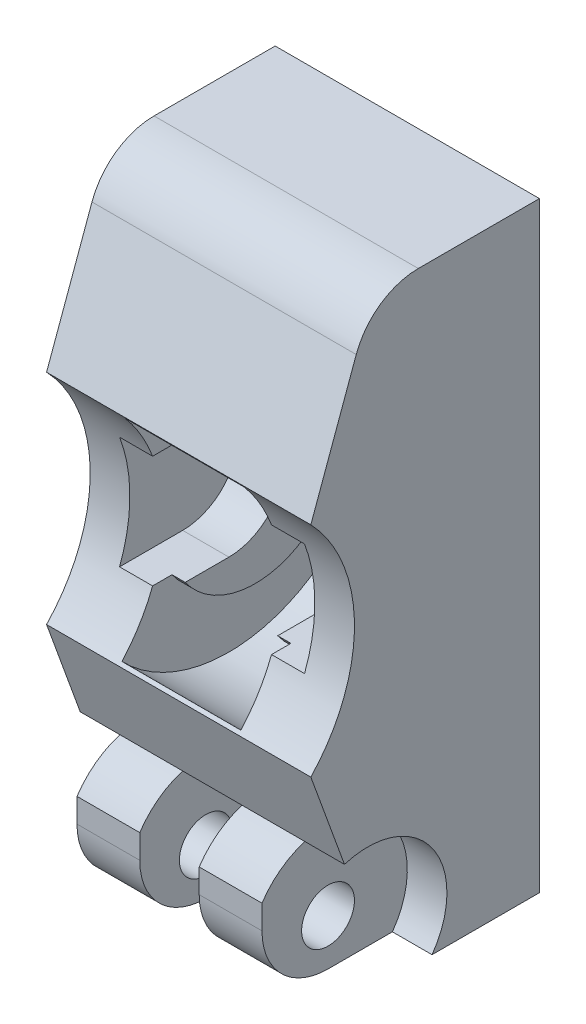
ISO-10303-21;
HEADER;
FILE_DESCRIPTION(('STEP AP214'),'2;1');
FILE_NAME('part.step','',(''),(''),'','','');
FILE_SCHEMA(('AUTOMOTIVE_DESIGN { 1 0 10303 214 1 1 1 1 }'));
ENDSEC;
DATA;
#1=APPLICATION_CONTEXT('core data for automotive mechanical design processes');
#2=APPLICATION_PROTOCOL_DEFINITION('international standard','automotive_design',2000,#1);
#3=PRODUCT_CONTEXT('',#1,'mechanical');
#4=PRODUCT('Part','Part','',(#3));
#5=PRODUCT_RELATED_PRODUCT_CATEGORY('part','',(#4));
#6=PRODUCT_DEFINITION_FORMATION('','',#4);
#7=PRODUCT_DEFINITION_CONTEXT('part definition',#1,'design');
#8=PRODUCT_DEFINITION('design','',#6,#7);
#9=PRODUCT_DEFINITION_SHAPE('','',#8);
#10=(LENGTH_UNIT() NAMED_UNIT(*) SI_UNIT(.MILLI.,.METRE.));
#11=(NAMED_UNIT(*) PLANE_ANGLE_UNIT() SI_UNIT($,.RADIAN.));
#12=(NAMED_UNIT(*) SI_UNIT($,.STERADIAN.) SOLID_ANGLE_UNIT());
#13=UNCERTAINTY_MEASURE_WITH_UNIT(LENGTH_MEASURE(1.E-05),#10,'distance_accuracy_value','');
#14=(GEOMETRIC_REPRESENTATION_CONTEXT(3) GLOBAL_UNCERTAINTY_ASSIGNED_CONTEXT((#13)) GLOBAL_UNIT_ASSIGNED_CONTEXT((#10,
#11,#12)) REPRESENTATION_CONTEXT('',''));
#15=CARTESIAN_POINT('',(0.,0.,0.));
#16=DIRECTION('',(0.,0.,1.));
#17=DIRECTION('',(1.,0.,0.));
#18=AXIS2_PLACEMENT_3D('',#15,#16,#17);
#19=CARTESIAN_POINT('',(20.,-22.75,18.));
#20=DIRECTION('',(0.,0.,-1.));
#21=DIRECTION('',(-1.,0.,0.));
#22=AXIS2_PLACEMENT_3D('',#19,#20,#21);
#23=PLANE('',#22);
#24=DIRECTION('',(0.,1.,0.));
#25=VECTOR('',#24,1.);
#26=CARTESIAN_POINT('',(17.,-22.75,18.));
#27=LINE('',#26,#25);
#28=CARTESIAN_POINT('',(17.,-17.75,18.));
#29=VERTEX_POINT('',#28);
#30=CARTESIAN_POINT('',(17.,-15.9333752096446,18.));
#31=VERTEX_POINT('',#30);
#32=EDGE_CURVE('E618',#29,#31,#27,.T.);
#33=ORIENTED_EDGE('',*,*,#32,.T.);
#34=DIRECTION('',(-1.,0.,0.));
#35=VECTOR('',#34,1.);
#36=CARTESIAN_POINT('',(29.9592339664477,-15.9333752096446,18.));
#37=LINE('',#36,#35);
#38=CARTESIAN_POINT('',(12.25,-15.9333752096446,18.));
#39=VERTEX_POINT('',#38);
#40=EDGE_CURVE('E264',#31,#39,#37,.T.);
#41=ORIENTED_EDGE('',*,*,#40,.T.);
#42=DIRECTION('',(0.,1.,0.));
#43=VECTOR('',#42,1.);
#44=CARTESIAN_POINT('',(12.25,-22.75,18.));
#45=LINE('',#44,#43);
#46=CARTESIAN_POINT('',(12.25,-17.75,18.));
#47=VERTEX_POINT('',#46);
#48=EDGE_CURVE('E386',#47,#39,#45,.T.);
#49=ORIENTED_EDGE('',*,*,#48,.F.);
#50=DIRECTION('',(-1.,0.,0.));
#51=VECTOR('',#50,1.);
#52=CARTESIAN_POINT('',(20.,-17.75,18.));
#53=LINE('',#52,#51);
#54=EDGE_CURVE('E318',#47,#29,#53,.F.);
#55=ORIENTED_EDGE('',*,*,#54,.T.);
#56=EDGE_LOOP('',(#33,#41,#49,#55));
#57=FACE_BOUND('',#56,.T.);
#58=ADVANCED_FACE('F35',(#57),#23,.F.);
#59=CARTESIAN_POINT('',(20.001,-19.25,13.));
#60=DIRECTION('',(-1.,0.,0.));
#61=DIRECTION('',(0.,0.,1.));
#62=AXIS2_PLACEMENT_3D('',#59,#60,#61);
#63=CYLINDRICAL_SURFACE('',#62,2.00000000000001);
#64=CARTESIAN_POINT('',(7.75,-19.25,13.));
#65=DIRECTION('',(-1.,0.,0.));
#66=DIRECTION('',(0.,0.,1.));
#67=AXIS2_PLACEMENT_3D('',#64,#65,#66);
#68=CIRCLE('',#67,2.00000000000001);
#69=CARTESIAN_POINT('',(7.75,-19.25,15.));
#70=VERTEX_POINT('',#69);
#71=EDGE_CURVE('E373',#70,#70,#68,.F.);
#72=ORIENTED_EDGE('',*,*,#71,.T.);
#73=EDGE_LOOP('',(#72));
#74=FACE_BOUND('',#73,.T.);
#75=CARTESIAN_POINT('',(3.,-19.25,13.));
#76=DIRECTION('',(-1.,0.,0.));
#77=DIRECTION('',(0.,0.,1.));
#78=AXIS2_PLACEMENT_3D('',#75,#76,#77);
#79=CIRCLE('',#78,2.00000000000001);
#80=CARTESIAN_POINT('',(3.,-19.25,15.));
#81=VERTEX_POINT('',#80);
#82=EDGE_CURVE('E601',#81,#81,#79,.F.);
#83=ORIENTED_EDGE('',*,*,#82,.F.);
#84=EDGE_LOOP('',(#83));
#85=FACE_BOUND('',#84,.T.);
#86=ADVANCED_FACE('F570',(#74,#85),#63,.F.);
#87=CARTESIAN_POINT('',(20.,-17.75,13.));
#88=DIRECTION('',(-1.,0.,0.));
#89=DIRECTION('',(0.,0.,1.));
#90=AXIS2_PLACEMENT_3D('',#87,#88,#89);
#91=CYLINDRICAL_SURFACE('',#90,5.);
#92=CARTESIAN_POINT('',(3.,-17.75,18.));
#93=VERTEX_POINT('',#92);
#94=CARTESIAN_POINT('',(7.75,-17.75,18.));
#95=VERTEX_POINT('',#94);
#96=EDGE_CURVE('E319',#93,#95,#53,.F.);
#97=ORIENTED_EDGE('',*,*,#96,.F.);
#98=CARTESIAN_POINT('',(3.,-17.75,13.));
#99=DIRECTION('',(-1.,0.,0.));
#100=DIRECTION('',(0.,0.,1.));
#101=AXIS2_PLACEMENT_3D('',#98,#99,#100);
#102=CIRCLE('',#101,5.);
#103=CARTESIAN_POINT('',(3.,-22.75,13.));
#104=VERTEX_POINT('',#103);
#105=EDGE_CURVE('E43',#93,#104,#102,.F.);
#106=ORIENTED_EDGE('',*,*,#105,.T.);
#107=DIRECTION('',(-1.,0.,0.));
#108=VECTOR('',#107,1.);
#109=CARTESIAN_POINT('',(20.,-22.75,13.));
#110=LINE('',#109,#108);
#111=CARTESIAN_POINT('',(7.75,-22.75,13.));
#112=VERTEX_POINT('',#111);
#113=EDGE_CURVE('E313',#112,#104,#110,.T.);
#114=ORIENTED_EDGE('',*,*,#113,.F.);
#115=CARTESIAN_POINT('',(7.75,-17.75,13.));
#116=DIRECTION('',(-1.,0.,0.));
#117=DIRECTION('',(0.,0.,1.));
#118=AXIS2_PLACEMENT_3D('',#115,#116,#117);
#119=CIRCLE('',#118,5.);
#120=EDGE_CURVE('E339',#95,#112,#119,.F.);
#121=ORIENTED_EDGE('',*,*,#120,.F.);
#122=EDGE_LOOP('',(#97,#106,#114,#121));
#123=FACE_BOUND('',#122,.T.);
#124=ADVANCED_FACE('F351',(#123),#91,.T.);
#125=DIRECTION('',(0.,1.,0.));
#126=VECTOR('',#125,1.);
#127=CARTESIAN_POINT('',(7.75,-22.75,18.));
#128=LINE('',#127,#126);
#129=CARTESIAN_POINT('',(7.75,-15.9333752096446,18.));
#130=VERTEX_POINT('',#129);
#131=EDGE_CURVE('E369',#95,#130,#128,.T.);
#132=ORIENTED_EDGE('',*,*,#131,.T.);
#133=CARTESIAN_POINT('',(3.,-15.9333752096446,18.));
#134=VERTEX_POINT('',#133);
#135=EDGE_CURVE('E274',#130,#134,#37,.T.);
#136=ORIENTED_EDGE('',*,*,#135,.T.);
#137=DIRECTION('',(0.,1.,0.));
#138=VECTOR('',#137,1.);
#139=CARTESIAN_POINT('',(3.,-22.75,18.));
#140=LINE('',#139,#138);
#141=EDGE_CURVE('E605',#93,#134,#140,.T.);
#142=ORIENTED_EDGE('',*,*,#141,.F.);
#143=ORIENTED_EDGE('',*,*,#96,.T.);
#144=EDGE_LOOP('',(#132,#136,#142,#143));
#145=FACE_BOUND('',#144,.T.);
#146=ADVANCED_FACE('F573',(#145),#23,.F.);
#147=CARTESIAN_POINT('',(20.,-22.75,0.));
#148=DIRECTION('',(0.,1.,0.));
#149=DIRECTION('',(0.,0.,1.));
#150=AXIS2_PLACEMENT_3D('',#147,#148,#149);
#151=PLANE('',#150);
#152=DIRECTION('',(0.,0.,-1.));
#153=VECTOR('',#152,1.);
#154=CARTESIAN_POINT('',(20.,-22.75,0.));
#155=LINE('',#154,#153);
#156=CARTESIAN_POINT('',(20.,-22.75,8.12660282759551));
#157=VERTEX_POINT('',#156);
#158=CARTESIAN_POINT('',(20.,-22.75,0.));
#159=VERTEX_POINT('',#158);
#160=EDGE_CURVE('E296',#157,#159,#155,.T.);
#161=ORIENTED_EDGE('',*,*,#160,.F.);
#162=DIRECTION('',(-1.,0.,0.));
#163=VECTOR('',#162,1.);
#164=CARTESIAN_POINT('',(20.,-22.75,8.12660282759551));
#165=LINE('',#164,#163);
#166=CARTESIAN_POINT('',(17.,-22.75,8.12660282759551));
#167=VERTEX_POINT('',#166);
#168=EDGE_CURVE('E623',#157,#167,#165,.T.);
#169=ORIENTED_EDGE('',*,*,#168,.T.);
#170=DIRECTION('',(0.,0.,1.));
#171=VECTOR('',#170,1.);
#172=CARTESIAN_POINT('',(17.,-22.75,0.));
#173=LINE('',#172,#171);
#174=CARTESIAN_POINT('',(17.,-22.75,13.));
#175=VERTEX_POINT('',#174);
#176=EDGE_CURVE('E620',#167,#175,#173,.T.);
#177=ORIENTED_EDGE('',*,*,#176,.T.);
#178=CARTESIAN_POINT('',(12.25,-22.75,13.));
#179=VERTEX_POINT('',#178);
#180=EDGE_CURVE('E314',#175,#179,#110,.T.);
#181=ORIENTED_EDGE('',*,*,#180,.T.);
#182=DIRECTION('',(0.,0.,1.));
#183=VECTOR('',#182,1.);
#184=CARTESIAN_POINT('',(12.25,-22.75,0.));
#185=LINE('',#184,#183);
#186=CARTESIAN_POINT('',(12.25,-22.75,8.12660282759551));
#187=VERTEX_POINT('',#186);
#188=EDGE_CURVE('E383',#187,#179,#185,.T.);
#189=ORIENTED_EDGE('',*,*,#188,.F.);
#190=DIRECTION('',(-1.,0.,0.));
#191=VECTOR('',#190,1.);
#192=CARTESIAN_POINT('',(12.25,-22.75,8.12660282759551));
#193=LINE('',#192,#191);
#194=CARTESIAN_POINT('',(7.75,-22.75,8.12660282759551));
#195=VERTEX_POINT('',#194);
#196=EDGE_CURVE('E344',#187,#195,#193,.T.);
#197=ORIENTED_EDGE('',*,*,#196,.T.);
#198=DIRECTION('',(0.,0.,1.));
#199=VECTOR('',#198,1.);
#200=CARTESIAN_POINT('',(7.75,-22.75,0.));
#201=LINE('',#200,#199);
#202=EDGE_CURVE('E364',#195,#112,#201,.T.);
#203=ORIENTED_EDGE('',*,*,#202,.T.);
#204=ORIENTED_EDGE('',*,*,#113,.T.);
#205=DIRECTION('',(0.,0.,1.));
#206=VECTOR('',#205,1.);
#207=CARTESIAN_POINT('',(3.,-22.75,0.));
#208=LINE('',#207,#206);
#209=CARTESIAN_POINT('',(3.,-22.75,8.12660282759551));
#210=VERTEX_POINT('',#209);
#211=EDGE_CURVE('E362',#210,#104,#208,.T.);
#212=ORIENTED_EDGE('',*,*,#211,.F.);
#213=DIRECTION('',(-1.,0.,0.));
#214=VECTOR('',#213,1.);
#215=CARTESIAN_POINT('',(3.,-22.75,8.12660282759551));
#216=LINE('',#215,#214);
#217=CARTESIAN_POINT('',(0.,-22.75,8.12660282759551));
#218=VERTEX_POINT('',#217);
#219=EDGE_CURVE('E598',#210,#218,#216,.T.);
#220=ORIENTED_EDGE('',*,*,#219,.T.);
#221=DIRECTION('',(0.,0.,-1.));
#222=VECTOR('',#221,1.);
#223=CARTESIAN_POINT('',(0.,-22.75,0.));
#224=LINE('',#223,#222);
#225=CARTESIAN_POINT('',(0.,-22.75,0.));
#226=VERTEX_POINT('',#225);
#227=EDGE_CURVE('E305',#218,#226,#224,.T.);
#228=ORIENTED_EDGE('',*,*,#227,.T.);
#229=DIRECTION('',(-1.,0.,0.));
#230=VECTOR('',#229,1.);
#231=CARTESIAN_POINT('',(20.,-22.75,0.));
#232=LINE('',#231,#230);
#233=EDGE_CURVE('E310',#159,#226,#232,.T.);
#234=ORIENTED_EDGE('',*,*,#233,.F.);
#235=EDGE_LOOP('',(#161,#169,#177,#181,#189,#197,#203,#204,#212,#220,#228,#234));
#236=FACE_BOUND('',#235,.T.);
#237=ADVANCED_FACE('F360',(#236),#151,.F.);
#238=CARTESIAN_POINT('',(17.,-19.25,13.));
#239=DIRECTION('',(-1.,0.,0.));
#240=DIRECTION('',(0.,0.,1.));
#241=AXIS2_PLACEMENT_3D('',#238,#239,#240);
#242=CIRCLE('',#241,2.00000000000001);
#243=CARTESIAN_POINT('',(17.,-19.25,15.));
#244=VERTEX_POINT('',#243);
#245=EDGE_CURVE('E613',#244,#244,#242,.F.);
#246=ORIENTED_EDGE('',*,*,#245,.T.);
#247=EDGE_LOOP('',(#246));
#248=FACE_BOUND('',#247,.T.);
#249=CARTESIAN_POINT('',(12.25,-19.25,13.));
#250=DIRECTION('',(-1.,0.,0.));
#251=DIRECTION('',(0.,0.,1.));
#252=AXIS2_PLACEMENT_3D('',#249,#250,#251);
#253=CIRCLE('',#252,2.00000000000001);
#254=CARTESIAN_POINT('',(12.25,-19.25,15.));
#255=VERTEX_POINT('',#254);
#256=EDGE_CURVE('E389',#255,#255,#253,.F.);
#257=ORIENTED_EDGE('',*,*,#256,.F.);
#258=EDGE_LOOP('',(#257));
#259=FACE_BOUND('',#258,.T.);
#260=ADVANCED_FACE('F579',(#248,#259),#63,.F.);
#261=CARTESIAN_POINT('',(17.,-17.75,13.));
#262=DIRECTION('',(-1.,0.,0.));
#263=DIRECTION('',(0.,0.,1.));
#264=AXIS2_PLACEMENT_3D('',#261,#262,#263);
#265=CIRCLE('',#264,5.);
#266=EDGE_CURVE('E11',#29,#175,#265,.F.);
#267=ORIENTED_EDGE('',*,*,#266,.F.);
#268=ORIENTED_EDGE('',*,*,#54,.F.);
#269=CARTESIAN_POINT('',(12.25,-17.75,13.));
#270=DIRECTION('',(-1.,0.,0.));
#271=DIRECTION('',(0.,0.,1.));
#272=AXIS2_PLACEMENT_3D('',#269,#270,#271);
#273=CIRCLE('',#272,5.);
#274=EDGE_CURVE('E341',#47,#179,#273,.F.);
#275=ORIENTED_EDGE('',*,*,#274,.T.);
#276=ORIENTED_EDGE('',*,*,#180,.F.);
#277=EDGE_LOOP('',(#267,#268,#275,#276));
#278=FACE_BOUND('',#277,.T.);
#279=ADVANCED_FACE('F588',(#278),#91,.T.);
#280=CARTESIAN_POINT('',(5.5,0.,0.));
#281=DIRECTION('',(-1.,0.,0.));
#282=DIRECTION('',(0.,0.,1.));
#283=AXIS2_PLACEMENT_3D('',#280,#281,#282);
#284=PLANE('',#283);
#285=CARTESIAN_POINT('',(5.5,1.26386815452523,8.00985088379567));
#286=DIRECTION('',(1.,0.,0.));
#287=DIRECTION('',(0.,0.,-1.));
#288=AXIS2_PLACEMENT_3D('',#285,#286,#287);
#289=CIRCLE('',#288,6.5);
#290=CARTESIAN_POINT('',(5.5,-2.5,13.3092184418493));
#291=VERTEX_POINT('',#290);
#292=CARTESIAN_POINT('',(5.5,6.,12.4617106235314));
#293=VERTEX_POINT('',#292);
#294=EDGE_CURVE('E412',#291,#293,#289,.T.);
#295=ORIENTED_EDGE('',*,*,#294,.F.);
#296=DIRECTION('',(0.,0.,-1.));
#297=VECTOR('',#296,1.);
#298=CARTESIAN_POINT('',(5.5,-2.5,9.99999999999999));
#299=LINE('',#298,#297);
#300=CARTESIAN_POINT('',(5.5,-2.5,14.7778121562683));
#301=VERTEX_POINT('',#300);
#302=EDGE_CURVE('E328',#301,#291,#299,.T.);
#303=ORIENTED_EDGE('',*,*,#302,.F.);
#304=CARTESIAN_POINT('',(5.5,1.75,26.));
#305=DIRECTION('',(-1.,0.,0.));
#306=DIRECTION('',(0.,0.,1.));
#307=AXIS2_PLACEMENT_3D('',#304,#305,#306);
#308=CIRCLE('',#307,12.);
#309=CARTESIAN_POINT('',(5.5,-6.29530641691925,17.0964588697599));
#310=VERTEX_POINT('',#309);
#311=EDGE_CURVE('E434',#310,#301,#308,.F.);
#312=ORIENTED_EDGE('',*,*,#311,.F.);
#313=CARTESIAN_POINT('',(5.5,1.51790026648036,9.00224480522709));
#314=DIRECTION('',(-1.,0.,0.));
#315=DIRECTION('',(0.,0.,1.));
#316=AXIS2_PLACEMENT_3D('',#313,#314,#315);
#317=CIRCLE('',#316,11.25);
#318=CARTESIAN_POINT('',(5.5,-5.22910562256125,0.));
#319=VERTEX_POINT('',#318);
#320=EDGE_CURVE('E430',#319,#310,#317,.T.);
#321=ORIENTED_EDGE('',*,*,#320,.F.);
#322=DIRECTION('',(0.,-1.,0.));
#323=VECTOR('',#322,1.);
#324=CARTESIAN_POINT('',(5.5,22.75,0.));
#325=LINE('',#324,#323);
#326=CARTESIAN_POINT('',(5.5,8.26490615552198,0.));
#327=VERTEX_POINT('',#326);
#328=EDGE_CURVE('E444',#327,#319,#325,.T.);
#329=ORIENTED_EDGE('',*,*,#328,.F.);
#330=CARTESIAN_POINT('',(5.5,9.54920130797869,16.8801064174178));
#331=VERTEX_POINT('',#330);
#332=EDGE_CURVE('E436',#331,#327,#317,.T.);
#333=ORIENTED_EDGE('',*,*,#332,.F.);
#334=CARTESIAN_POINT('',(5.5,6.,14.7778121562683));
#335=VERTEX_POINT('',#334);
#336=EDGE_CURVE('E442',#335,#331,#308,.F.);
#337=ORIENTED_EDGE('',*,*,#336,.F.);
#338=DIRECTION('',(0.,0.,1.));
#339=VECTOR('',#338,1.);
#340=CARTESIAN_POINT('',(5.5,6.,9.99999999999999));
#341=LINE('',#340,#339);
#342=EDGE_CURVE('E441',#293,#335,#341,.T.);
#343=ORIENTED_EDGE('',*,*,#342,.F.);
#344=EDGE_LOOP('',(#295,#303,#312,#321,#329,#333,#337,#343));
#345=FACE_BOUND('',#344,.T.);
#346=ADVANCED_FACE('F523',(#345),#284,.F.);
#347=CARTESIAN_POINT('',(20.001,1.75,26.));
#348=DIRECTION('',(-1.,0.,0.));
#349=DIRECTION('',(0.,0.,1.));
#350=AXIS2_PLACEMENT_3D('',#347,#348,#349);
#351=CYLINDRICAL_SURFACE('',#350,12.);
#352=CARTESIAN_POINT('',(0.,1.75,26.));
#353=DIRECTION('',(-1.,0.,0.));
#354=DIRECTION('',(0.,0.,1.));
#355=AXIS2_PLACEMENT_3D('',#352,#353,#354);
#356=CIRCLE('',#355,12.);
#357=CARTESIAN_POINT('',(0.,10.0172706018741,17.3021705698842));
#358=VERTEX_POINT('',#357);
#359=CARTESIAN_POINT('',(0.,-6.51727060187409,17.3021705698842));
#360=VERTEX_POINT('',#359);
#361=EDGE_CURVE('E271',#358,#360,#356,.T.);
#362=ORIENTED_EDGE('',*,*,#361,.T.);
#363=DIRECTION('',(-1.,0.,0.));
#364=VECTOR('',#363,1.);
#365=CARTESIAN_POINT('',(29.9592339664477,-6.51727060187409,17.3021705698842));
#366=LINE('',#365,#364);
#367=CARTESIAN_POINT('',(20.,-6.51727060187409,17.3021705698842));
#368=VERTEX_POINT('',#367);
#369=EDGE_CURVE('E254',#368,#360,#366,.T.);
#370=ORIENTED_EDGE('',*,*,#369,.F.);
#371=CARTESIAN_POINT('',(20.,1.75,26.));
#372=DIRECTION('',(-1.,0.,0.));
#373=DIRECTION('',(0.,0.,1.));
#374=AXIS2_PLACEMENT_3D('',#371,#372,#373);
#375=CIRCLE('',#374,12.);
#376=CARTESIAN_POINT('',(20.,10.0172706018741,17.3021705698842));
#377=VERTEX_POINT('',#376);
#378=EDGE_CURVE('E281',#368,#377,#375,.F.);
#379=ORIENTED_EDGE('',*,*,#378,.T.);
#380=DIRECTION('',(-1.,0.,0.));
#381=VECTOR('',#380,1.);
#382=CARTESIAN_POINT('',(20.001,10.0172706018741,17.3021705698842));
#383=LINE('',#382,#381);
#384=EDGE_CURVE('E280',#377,#358,#383,.T.);
#385=ORIENTED_EDGE('',*,*,#384,.T.);
#386=EDGE_LOOP('',(#362,#370,#379,#385));
#387=FACE_BOUND('',#386,.T.);
#388=CARTESIAN_POINT('',(14.5,1.75,26.));
#389=DIRECTION('',(-1.,0.,0.));
#390=DIRECTION('',(0.,0.,1.));
#391=AXIS2_PLACEMENT_3D('',#388,#389,#390);
#392=CIRCLE('',#391,12.);
#393=CARTESIAN_POINT('',(14.5,-6.29530641691925,17.0964588697599));
#394=VERTEX_POINT('',#393);
#395=CARTESIAN_POINT('',(14.5,-2.5,14.7778121562683));
#396=VERTEX_POINT('',#395);
#397=EDGE_CURVE('E447',#394,#396,#392,.F.);
#398=ORIENTED_EDGE('',*,*,#397,.F.);
#399=DIRECTION('',(-1.,0.,0.));
#400=VECTOR('',#399,1.);
#401=CARTESIAN_POINT('',(10.,-6.29530641691926,17.0964588697598));
#402=LINE('',#401,#400);
#403=EDGE_CURVE('E457',#394,#310,#402,.T.);
#404=ORIENTED_EDGE('',*,*,#403,.T.);
#405=ORIENTED_EDGE('',*,*,#311,.T.);
#406=DIRECTION('',(-1.,0.,0.));
#407=VECTOR('',#406,1.);
#408=CARTESIAN_POINT('',(17.,-2.5,14.7778121562683));
#409=LINE('',#408,#407);
#410=CARTESIAN_POINT('',(3.,-2.5,14.7778121562683));
#411=VERTEX_POINT('',#410);
#412=EDGE_CURVE('E492',#301,#411,#409,.T.);
#413=ORIENTED_EDGE('',*,*,#412,.T.);
#414=CARTESIAN_POINT('',(3.,1.75,26.));
#415=DIRECTION('',(1.,0.,0.));
#416=DIRECTION('',(0.,0.,1.));
#417=AXIS2_PLACEMENT_3D('',#414,#415,#416);
#418=CIRCLE('',#417,12.);
#419=CARTESIAN_POINT('',(3.,6.,14.7778121562683));
#420=VERTEX_POINT('',#419);
#421=EDGE_CURVE('E479',#411,#420,#418,.T.);
#422=ORIENTED_EDGE('',*,*,#421,.T.);
#423=DIRECTION('',(-1.,0.,0.));
#424=VECTOR('',#423,1.);
#425=CARTESIAN_POINT('',(17.,6.,14.7778121562683));
#426=LINE('',#425,#424);
#427=EDGE_CURVE('E489',#335,#420,#426,.T.);
#428=ORIENTED_EDGE('',*,*,#427,.F.);
#429=ORIENTED_EDGE('',*,*,#336,.T.);
#430=DIRECTION('',(-1.,0.,0.));
#431=VECTOR('',#430,1.);
#432=CARTESIAN_POINT('',(10.,9.54920130797869,16.8801064174178));
#433=LINE('',#432,#431);
#434=CARTESIAN_POINT('',(14.5,9.54920130797869,16.8801064174178));
#435=VERTEX_POINT('',#434);
#436=EDGE_CURVE('E454',#331,#435,#433,.F.);
#437=ORIENTED_EDGE('',*,*,#436,.T.);
#438=CARTESIAN_POINT('',(14.5,6.,14.7778121562683));
#439=VERTEX_POINT('',#438);
#440=EDGE_CURVE('E450',#439,#435,#392,.F.);
#441=ORIENTED_EDGE('',*,*,#440,.F.);
#442=CARTESIAN_POINT('',(17.,6.,14.7778121562683));
#443=VERTEX_POINT('',#442);
#444=EDGE_CURVE('E486',#443,#439,#426,.T.);
#445=ORIENTED_EDGE('',*,*,#444,.F.);
#446=CARTESIAN_POINT('',(17.,1.75,26.));
#447=DIRECTION('',(1.,0.,0.));
#448=DIRECTION('',(0.,0.,1.));
#449=AXIS2_PLACEMENT_3D('',#446,#447,#448);
#450=CIRCLE('',#449,12.);
#451=CARTESIAN_POINT('',(17.,-2.5,14.7778121562683));
#452=VERTEX_POINT('',#451);
#453=EDGE_CURVE('E468',#452,#443,#450,.T.);
#454=ORIENTED_EDGE('',*,*,#453,.F.);
#455=EDGE_CURVE('E490',#452,#396,#409,.T.);
#456=ORIENTED_EDGE('',*,*,#455,.T.);
#457=EDGE_LOOP('',(#398,#404,#405,#413,#422,#428,#429,#437,#441,#445,#454,#456));
#458=FACE_BOUND('',#457,.T.);
#459=ADVANCED_FACE('F277',(#387,#458),#351,.F.);
#460=CARTESIAN_POINT('',(20.,22.75,0.));
#461=DIRECTION('',(0.,0.,1.));
#462=DIRECTION('',(1.,0.,0.));
#463=AXIS2_PLACEMENT_3D('',#460,#461,#462);
#464=PLANE('',#463);
#465=DIRECTION('',(0.,1.,0.));
#466=VECTOR('',#465,1.);
#467=CARTESIAN_POINT('',(0.,22.75,0.));
#468=LINE('',#467,#466);
#469=CARTESIAN_POINT('',(0.,22.75,0.));
#470=VERTEX_POINT('',#469);
#471=EDGE_CURVE('E293',#226,#470,#468,.T.);
#472=ORIENTED_EDGE('',*,*,#471,.T.);
#473=DIRECTION('',(-1.,0.,0.));
#474=VECTOR('',#473,1.);
#475=CARTESIAN_POINT('',(20.,22.75,0.));
#476=LINE('',#475,#474);
#477=CARTESIAN_POINT('',(20.,22.75,0.));
#478=VERTEX_POINT('',#477);
#479=EDGE_CURVE('E300',#478,#470,#476,.T.);
#480=ORIENTED_EDGE('',*,*,#479,.F.);
#481=DIRECTION('',(0.,1.,0.));
#482=VECTOR('',#481,1.);
#483=CARTESIAN_POINT('',(20.,22.75,0.));
#484=LINE('',#483,#482);
#485=EDGE_CURVE('E298',#159,#478,#484,.T.);
#486=ORIENTED_EDGE('',*,*,#485,.F.);
#487=ORIENTED_EDGE('',*,*,#233,.T.);
#488=EDGE_LOOP('',(#472,#480,#486,#487));
#489=FACE_BOUND('',#488,.T.);
#490=DIRECTION('',(0.,-1.,0.));
#491=VECTOR('',#490,1.);
#492=CARTESIAN_POINT('',(14.5,22.75,0.));
#493=LINE('',#492,#491);
#494=CARTESIAN_POINT('',(14.5,8.26490615552198,0.));
#495=VERTEX_POINT('',#494);
#496=CARTESIAN_POINT('',(14.5,-5.22910562256125,0.));
#497=VERTEX_POINT('',#496);
#498=EDGE_CURVE('E452',#495,#497,#493,.T.);
#499=ORIENTED_EDGE('',*,*,#498,.F.);
#500=DIRECTION('',(-1.,0.,0.));
#501=VECTOR('',#500,1.);
#502=CARTESIAN_POINT('',(14.5,8.26490615552198,0.));
#503=LINE('',#502,#501);
#504=EDGE_CURVE('E336',#495,#327,#503,.T.);
#505=ORIENTED_EDGE('',*,*,#504,.T.);
#506=ORIENTED_EDGE('',*,*,#328,.T.);
#507=DIRECTION('',(-1.,0.,0.));
#508=VECTOR('',#507,1.);
#509=CARTESIAN_POINT('',(14.5,-5.22910562256125,0.));
#510=LINE('',#509,#508);
#511=EDGE_CURVE('E333',#319,#497,#510,.F.);
#512=ORIENTED_EDGE('',*,*,#511,.T.);
#513=EDGE_LOOP('',(#499,#505,#506,#512));
#514=FACE_BOUND('',#513,.T.);
#515=ADVANCED_FACE('F555',(#489,#514),#464,.F.);
#516=CARTESIAN_POINT('',(17.,1.75,9.99999999999999));
#517=DIRECTION('',(-1.,0.,0.));
#518=DIRECTION('',(0.,0.,1.));
#519=AXIS2_PLACEMENT_3D('',#516,#517,#518);
#520=CYLINDRICAL_SURFACE('',#519,4.25);
#521=DIRECTION('',(-1.,0.,0.));
#522=VECTOR('',#521,1.);
#523=CARTESIAN_POINT('',(17.,6.,9.99999999999999));
#524=LINE('',#523,#522);
#525=CARTESIAN_POINT('',(17.,6.,9.99999999999999));
#526=VERTEX_POINT('',#525);
#527=CARTESIAN_POINT('',(13.5,6.,9.99999999999999));
#528=VERTEX_POINT('',#527);
#529=EDGE_CURVE('E285',#526,#528,#524,.T.);
#530=ORIENTED_EDGE('',*,*,#529,.T.);
#531=CARTESIAN_POINT('',(13.5,1.75,9.99999999999999));
#532=DIRECTION('',(1.,0.,0.));
#533=DIRECTION('',(0.,0.,-1.));
#534=AXIS2_PLACEMENT_3D('',#531,#532,#533);
#535=CIRCLE('',#534,4.25);
#536=CARTESIAN_POINT('',(13.5,-2.5,9.99999999999999));
#537=VERTEX_POINT('',#536);
#538=EDGE_CURVE('E396',#528,#537,#535,.F.);
#539=ORIENTED_EDGE('',*,*,#538,.T.);
#540=DIRECTION('',(-1.,0.,0.));
#541=VECTOR('',#540,1.);
#542=CARTESIAN_POINT('',(17.,-2.5,9.99999999999999));
#543=LINE('',#542,#541);
#544=CARTESIAN_POINT('',(17.,-2.5,9.99999999999999));
#545=VERTEX_POINT('',#544);
#546=EDGE_CURVE('E493',#545,#537,#543,.T.);
#547=ORIENTED_EDGE('',*,*,#546,.F.);
#548=CARTESIAN_POINT('',(17.,1.75,9.99999999999999));
#549=DIRECTION('',(-1.,0.,0.));
#550=DIRECTION('',(0.,0.,1.));
#551=AXIS2_PLACEMENT_3D('',#548,#549,#550);
#552=CIRCLE('',#551,4.25);
#553=EDGE_CURVE('E461',#526,#545,#552,.T.);
#554=ORIENTED_EDGE('',*,*,#553,.F.);
#555=EDGE_LOOP('',(#530,#539,#547,#554));
#556=FACE_BOUND('',#555,.T.);
#557=ADVANCED_FACE('F557',(#556),#520,.F.);
#558=CARTESIAN_POINT('',(17.,6.,9.99999999999999));
#559=DIRECTION('',(0.,1.,0.));
#560=DIRECTION('',(0.,0.,1.));
#561=AXIS2_PLACEMENT_3D('',#558,#559,#560);
#562=PLANE('',#561);
#563=DIRECTION('',(0.,0.,1.));
#564=VECTOR('',#563,1.);
#565=CARTESIAN_POINT('',(14.5,6.,9.99999999999999));
#566=LINE('',#565,#564);
#567=CARTESIAN_POINT('',(14.5,6.,12.4617106235314));
#568=VERTEX_POINT('',#567);
#569=EDGE_CURVE('E449',#568,#439,#566,.T.);
#570=ORIENTED_EDGE('',*,*,#569,.F.);
#571=DIRECTION('',(1.,0.,0.));
#572=VECTOR('',#571,1.);
#573=CARTESIAN_POINT('',(13.5,6.,12.4617106235314));
#574=LINE('',#573,#572);
#575=CARTESIAN_POINT('',(13.5,6.,12.4617106235314));
#576=VERTEX_POINT('',#575);
#577=EDGE_CURVE('E409',#576,#568,#574,.T.);
#578=ORIENTED_EDGE('',*,*,#577,.F.);
#579=DIRECTION('',(0.,0.,-1.));
#580=VECTOR('',#579,1.);
#581=CARTESIAN_POINT('',(13.5,6.,0.));
#582=LINE('',#581,#580);
#583=EDGE_CURVE('E399',#576,#528,#582,.T.);
#584=ORIENTED_EDGE('',*,*,#583,.T.);
#585=ORIENTED_EDGE('',*,*,#529,.F.);
#586=DIRECTION('',(0.,0.,-1.));
#587=VECTOR('',#586,1.);
#588=CARTESIAN_POINT('',(17.,6.,9.99999999999999));
#589=LINE('',#588,#587);
#590=EDGE_CURVE('E470',#443,#526,#589,.T.);
#591=ORIENTED_EDGE('',*,*,#590,.F.);
#592=ORIENTED_EDGE('',*,*,#444,.T.);
#593=EDGE_LOOP('',(#570,#578,#584,#585,#591,#592));
#594=FACE_BOUND('',#593,.T.);
#595=ADVANCED_FACE('F546',(#594),#562,.F.);
#596=CARTESIAN_POINT('',(17.,-2.5,9.99999999999999));
#597=DIRECTION('',(0.,-1.,0.));
#598=DIRECTION('',(0.,0.,-1.));
#599=AXIS2_PLACEMENT_3D('',#596,#597,#598);
#600=PLANE('',#599);
#601=DIRECTION('',(0.,0.,-1.));
#602=VECTOR('',#601,1.);
#603=CARTESIAN_POINT('',(14.5,-2.5,9.99999999999999));
#604=LINE('',#603,#602);
#605=CARTESIAN_POINT('',(14.5,-2.5,13.3092184418493));
#606=VERTEX_POINT('',#605);
#607=EDGE_CURVE('E331',#396,#606,#604,.T.);
#608=ORIENTED_EDGE('',*,*,#607,.F.);
#609=ORIENTED_EDGE('',*,*,#455,.F.);
#610=DIRECTION('',(0.,0.,1.));
#611=VECTOR('',#610,1.);
#612=CARTESIAN_POINT('',(17.,-2.5,9.99999999999999));
#613=LINE('',#612,#611);
#614=EDGE_CURVE('E464',#545,#452,#613,.T.);
#615=ORIENTED_EDGE('',*,*,#614,.F.);
#616=ORIENTED_EDGE('',*,*,#546,.T.);
#617=DIRECTION('',(0.,0.,1.));
#618=VECTOR('',#617,1.);
#619=CARTESIAN_POINT('',(13.5,-2.5,0.));
#620=LINE('',#619,#618);
#621=CARTESIAN_POINT('',(13.5,-2.5,13.3092184418493));
#622=VERTEX_POINT('',#621);
#623=EDGE_CURVE('E393',#537,#622,#620,.T.);
#624=ORIENTED_EDGE('',*,*,#623,.T.);
#625=DIRECTION('',(1.,0.,0.));
#626=VECTOR('',#625,1.);
#627=CARTESIAN_POINT('',(13.5,-2.5,13.3092184418493));
#628=LINE('',#627,#626);
#629=EDGE_CURVE('E405',#622,#606,#628,.T.);
#630=ORIENTED_EDGE('',*,*,#629,.T.);
#631=EDGE_LOOP('',(#608,#609,#615,#616,#624,#630));
#632=FACE_BOUND('',#631,.T.);
#633=ADVANCED_FACE('F538',(#632),#600,.F.);
#634=CARTESIAN_POINT('',(20.,22.75,12.6678360680002));
#635=DIRECTION('',(0.,-1.,0.));
#636=DIRECTION('',(0.,0.,-1.));
#637=AXIS2_PLACEMENT_3D('',#634,#635,#636);
#638=PLANE('',#637);
#639=DIRECTION('',(0.,0.,1.));
#640=VECTOR('',#639,1.);
#641=CARTESIAN_POINT('',(0.,22.75,12.6678360680002));
#642=LINE('',#641,#640);
#643=CARTESIAN_POINT('',(0.,22.75,9.16679837695162));
#644=VERTEX_POINT('',#643);
#645=EDGE_CURVE('E283',#470,#644,#642,.T.);
#646=ORIENTED_EDGE('',*,*,#645,.T.);
#647=DIRECTION('',(-1.,0.,0.));
#648=VECTOR('',#647,1.);
#649=CARTESIAN_POINT('',(20.,22.75,9.16679837695162));
#650=LINE('',#649,#648);
#651=CARTESIAN_POINT('',(20.,22.75,9.16679837695162));
#652=VERTEX_POINT('',#651);
#653=EDGE_CURVE('E326',#644,#652,#650,.F.);
#654=ORIENTED_EDGE('',*,*,#653,.T.);
#655=DIRECTION('',(0.,0.,1.));
#656=VECTOR('',#655,1.);
#657=CARTESIAN_POINT('',(20.,22.75,12.6678360680002));
#658=LINE('',#657,#656);
#659=EDGE_CURVE('E289',#478,#652,#658,.T.);
#660=ORIENTED_EDGE('',*,*,#659,.F.);
#661=ORIENTED_EDGE('',*,*,#479,.T.);
#662=EDGE_LOOP('',(#646,#654,#660,#661));
#663=FACE_BOUND('',#662,.T.);
#664=ADVANCED_FACE('F653',(#663),#638,.F.);
#665=CARTESIAN_POINT('',(20.,8.1,18.));
#666=DIRECTION('',(0.,-0.342020143325666,-0.93969262078591));
#667=DIRECTION('',(0.,0.93969262078591,-0.342020143325666));
#668=AXIS2_PLACEMENT_3D('',#665,#666,#667);
#669=PLANE('',#668);
#670=DIRECTION('',(0.,-0.93969262078591,0.342020143325666));
#671=VECTOR('',#670,1.);
#672=CARTESIAN_POINT('',(20.,8.1,18.));
#673=LINE('',#672,#671);
#674=CARTESIAN_POINT('',(20.,19.4601007166283,13.8652614808812));
#675=VERTEX_POINT('',#674);
#676=EDGE_CURVE('E292',#675,#377,#673,.T.);
#677=ORIENTED_EDGE('',*,*,#676,.F.);
#678=DIRECTION('',(-1.,0.,0.));
#679=VECTOR('',#678,1.);
#680=CARTESIAN_POINT('',(20.,19.4601007166283,13.8652614808812));
#681=LINE('',#680,#679);
#682=CARTESIAN_POINT('',(0.,19.4601007166283,13.8652614808812));
#683=VERTEX_POINT('',#682);
#684=EDGE_CURVE('E323',#675,#683,#681,.T.);
#685=ORIENTED_EDGE('',*,*,#684,.T.);
#686=DIRECTION('',(0.,-0.93969262078591,0.342020143325666));
#687=VECTOR('',#686,1.);
#688=CARTESIAN_POINT('',(0.,8.1,18.));
#689=LINE('',#688,#687);
#690=EDGE_CURVE('E303',#683,#358,#689,.T.);
#691=ORIENTED_EDGE('',*,*,#690,.T.);
#692=ORIENTED_EDGE('',*,*,#384,.F.);
#693=EDGE_LOOP('',(#677,#685,#691,#692));
#694=FACE_BOUND('',#693,.T.);
#695=ADVANCED_FACE('F659',(#694),#669,.F.);
#696=CARTESIAN_POINT('',(20.,0.,0.));
#697=DIRECTION('',(-1.,0.,0.));
#698=DIRECTION('',(0.,0.,1.));
#699=AXIS2_PLACEMENT_3D('',#696,#697,#698);
#700=PLANE('',#699);
#701=ORIENTED_EDGE('',*,*,#378,.F.);
#702=DIRECTION('',(0.,0.93969262078591,0.342020143325666));
#703=VECTOR('',#702,1.);
#704=CARTESIAN_POINT('',(20.,-6.51727060187409,17.3021705698842));
#705=LINE('',#704,#703);
#706=CARTESIAN_POINT('',(20.,-13.5127232518219,14.7560340300846));
#707=VERTEX_POINT('',#706);
#708=EDGE_CURVE('E259',#707,#368,#705,.T.);
#709=ORIENTED_EDGE('',*,*,#708,.F.);
#710=CARTESIAN_POINT('',(20.,-19.25,13.));
#711=DIRECTION('',(-1.,0.,0.));
#712=DIRECTION('',(0.,0.,1.));
#713=AXIS2_PLACEMENT_3D('',#710,#711,#712);
#714=CIRCLE('',#713,6.);
#715=EDGE_CURVE('E58',#707,#157,#714,.T.);
#716=ORIENTED_EDGE('',*,*,#715,.T.);
#717=ORIENTED_EDGE('',*,*,#160,.T.);
#718=ORIENTED_EDGE('',*,*,#485,.T.);
#719=ORIENTED_EDGE('',*,*,#659,.T.);
#720=CARTESIAN_POINT('',(20.,17.75,9.16679837695162));
#721=DIRECTION('',(-1.,0.,0.));
#722=DIRECTION('',(0.,0.,1.));
#723=AXIS2_PLACEMENT_3D('',#720,#721,#722);
#724=CIRCLE('',#723,5.);
#725=EDGE_CURVE('E321',#652,#675,#724,.F.);
#726=ORIENTED_EDGE('',*,*,#725,.T.);
#727=ORIENTED_EDGE('',*,*,#676,.T.);
#728=EDGE_LOOP('',(#701,#709,#716,#717,#718,#719,#726,#727));
#729=FACE_BOUND('',#728,.T.);
#730=ADVANCED_FACE('F646',(#729),#700,.F.);
#731=CARTESIAN_POINT('',(0.,0.,0.));
#732=DIRECTION('',(-1.,0.,0.));
#733=DIRECTION('',(0.,0.,1.));
#734=AXIS2_PLACEMENT_3D('',#731,#732,#733);
#735=PLANE('',#734);
#736=DIRECTION('',(0.,-0.93969262078591,-0.342020143325665));
#737=VECTOR('',#736,1.);
#738=CARTESIAN_POINT('',(0.,-6.51727060187409,17.3021705698842));
#739=LINE('',#738,#737);
#740=CARTESIAN_POINT('',(0.,-13.5127232518219,14.7560340300846));
#741=VERTEX_POINT('',#740);
#742=EDGE_CURVE('E257',#360,#741,#739,.T.);
#743=ORIENTED_EDGE('',*,*,#742,.F.);
#744=ORIENTED_EDGE('',*,*,#361,.F.);
#745=ORIENTED_EDGE('',*,*,#690,.F.);
#746=CARTESIAN_POINT('',(0.,17.75,9.16679837695162));
#747=DIRECTION('',(-1.,0.,0.));
#748=DIRECTION('',(0.,0.,1.));
#749=AXIS2_PLACEMENT_3D('',#746,#747,#748);
#750=CIRCLE('',#749,5.);
#751=EDGE_CURVE('E316',#683,#644,#750,.T.);
#752=ORIENTED_EDGE('',*,*,#751,.T.);
#753=ORIENTED_EDGE('',*,*,#645,.F.);
#754=ORIENTED_EDGE('',*,*,#471,.F.);
#755=ORIENTED_EDGE('',*,*,#227,.F.);
#756=CARTESIAN_POINT('',(0.,-19.25,13.));
#757=DIRECTION('',(-1.,0.,0.));
#758=DIRECTION('',(0.,0.,1.));
#759=AXIS2_PLACEMENT_3D('',#756,#757,#758);
#760=CIRCLE('',#759,6.);
#761=EDGE_CURVE('E273',#741,#218,#760,.T.);
#762=ORIENTED_EDGE('',*,*,#761,.F.);
#763=EDGE_LOOP('',(#743,#744,#745,#752,#753,#754,#755,#762));
#764=FACE_BOUND('',#763,.T.);
#765=ADVANCED_FACE('F269',(#764),#735,.T.);
#766=CARTESIAN_POINT('',(6.5,-2.5,9.99999999999999));
#767=VERTEX_POINT('',#766);
#768=CARTESIAN_POINT('',(3.,-2.5,9.99999999999999));
#769=VERTEX_POINT('',#768);
#770=EDGE_CURVE('E473',#767,#769,#543,.T.);
#771=ORIENTED_EDGE('',*,*,#770,.F.);
#772=CARTESIAN_POINT('',(6.5,1.75,9.99999999999999));
#773=DIRECTION('',(1.,0.,0.));
#774=DIRECTION('',(0.,0.,-1.));
#775=AXIS2_PLACEMENT_3D('',#772,#773,#774);
#776=CIRCLE('',#775,4.25);
#777=CARTESIAN_POINT('',(6.5,6.,9.99999999999999));
#778=VERTEX_POINT('',#777);
#779=EDGE_CURVE('E421',#778,#767,#776,.F.);
#780=ORIENTED_EDGE('',*,*,#779,.F.);
#781=CARTESIAN_POINT('',(3.,6.,9.99999999999999));
#782=VERTEX_POINT('',#781);
#783=EDGE_CURVE('E485',#778,#782,#524,.T.);
#784=ORIENTED_EDGE('',*,*,#783,.T.);
#785=CARTESIAN_POINT('',(3.,1.75,9.99999999999999));
#786=DIRECTION('',(-1.,0.,0.));
#787=DIRECTION('',(0.,0.,1.));
#788=AXIS2_PLACEMENT_3D('',#785,#786,#787);
#789=CIRCLE('',#788,4.25);
#790=EDGE_CURVE('E460',#782,#769,#789,.T.);
#791=ORIENTED_EDGE('',*,*,#790,.T.);
#792=EDGE_LOOP('',(#771,#780,#784,#791));
#793=FACE_BOUND('',#792,.T.);
#794=ADVANCED_FACE('F510',(#793),#520,.F.);
#795=ORIENTED_EDGE('',*,*,#783,.F.);
#796=DIRECTION('',(0.,0.,-1.));
#797=VECTOR('',#796,1.);
#798=CARTESIAN_POINT('',(6.5,6.,0.));
#799=LINE('',#798,#797);
#800=CARTESIAN_POINT('',(6.5,6.,12.4617106235314));
#801=VERTEX_POINT('',#800);
#802=EDGE_CURVE('E418',#801,#778,#799,.T.);
#803=ORIENTED_EDGE('',*,*,#802,.F.);
#804=DIRECTION('',(-1.,0.,0.));
#805=VECTOR('',#804,1.);
#806=CARTESIAN_POINT('',(6.5,6.,12.4617106235314));
#807=LINE('',#806,#805);
#808=EDGE_CURVE('E424',#801,#293,#807,.T.);
#809=ORIENTED_EDGE('',*,*,#808,.T.);
#810=ORIENTED_EDGE('',*,*,#342,.T.);
#811=ORIENTED_EDGE('',*,*,#427,.T.);
#812=DIRECTION('',(0.,0.,-1.));
#813=VECTOR('',#812,1.);
#814=CARTESIAN_POINT('',(3.,6.,9.99999999999999));
#815=LINE('',#814,#813);
#816=EDGE_CURVE('E465',#420,#782,#815,.T.);
#817=ORIENTED_EDGE('',*,*,#816,.T.);
#818=EDGE_LOOP('',(#795,#803,#809,#810,#811,#817));
#819=FACE_BOUND('',#818,.T.);
#820=ADVANCED_FACE('F513',(#819),#562,.F.);
#821=ORIENTED_EDGE('',*,*,#412,.F.);
#822=ORIENTED_EDGE('',*,*,#302,.T.);
#823=DIRECTION('',(-1.,0.,0.));
#824=VECTOR('',#823,1.);
#825=CARTESIAN_POINT('',(6.5,-2.5,13.3092184418493));
#826=LINE('',#825,#824);
#827=CARTESIAN_POINT('',(6.5,-2.5,13.3092184418493));
#828=VERTEX_POINT('',#827);
#829=EDGE_CURVE('E428',#828,#291,#826,.T.);
#830=ORIENTED_EDGE('',*,*,#829,.F.);
#831=DIRECTION('',(0.,0.,1.));
#832=VECTOR('',#831,1.);
#833=CARTESIAN_POINT('',(6.5,-2.5,0.));
#834=LINE('',#833,#832);
#835=EDGE_CURVE('E413',#767,#828,#834,.T.);
#836=ORIENTED_EDGE('',*,*,#835,.F.);
#837=ORIENTED_EDGE('',*,*,#770,.T.);
#838=DIRECTION('',(0.,0.,1.));
#839=VECTOR('',#838,1.);
#840=CARTESIAN_POINT('',(3.,-2.5,9.99999999999999));
#841=LINE('',#840,#839);
#842=EDGE_CURVE('E476',#769,#411,#841,.T.);
#843=ORIENTED_EDGE('',*,*,#842,.T.);
#844=EDGE_LOOP('',(#821,#822,#830,#836,#837,#843));
#845=FACE_BOUND('',#844,.T.);
#846=ADVANCED_FACE('F501',(#845),#600,.F.);
#847=CARTESIAN_POINT('',(17.,1.75,9.99999999999999));
#848=DIRECTION('',(-1.,0.,0.));
#849=DIRECTION('',(0.,0.,1.));
#850=AXIS2_PLACEMENT_3D('',#847,#848,#849);
#851=PLANE('',#850);
#852=ORIENTED_EDGE('',*,*,#553,.T.);
#853=ORIENTED_EDGE('',*,*,#614,.T.);
#854=ORIENTED_EDGE('',*,*,#453,.T.);
#855=ORIENTED_EDGE('',*,*,#590,.T.);
#856=EDGE_LOOP('',(#852,#853,#854,#855));
#857=FACE_BOUND('',#856,.T.);
#858=ADVANCED_FACE('F676',(#857),#851,.T.);
#859=CARTESIAN_POINT('',(3.,1.75,9.99999999999999));
#860=DIRECTION('',(-1.,0.,0.));
#861=DIRECTION('',(0.,0.,1.));
#862=AXIS2_PLACEMENT_3D('',#859,#860,#861);
#863=PLANE('',#862);
#864=ORIENTED_EDGE('',*,*,#790,.F.);
#865=ORIENTED_EDGE('',*,*,#816,.F.);
#866=ORIENTED_EDGE('',*,*,#421,.F.);
#867=ORIENTED_EDGE('',*,*,#842,.F.);
#868=EDGE_LOOP('',(#864,#865,#866,#867));
#869=FACE_BOUND('',#868,.T.);
#870=ADVANCED_FACE('F508',(#869),#863,.F.);
#871=CARTESIAN_POINT('',(20.,17.75,9.16679837695162));
#872=DIRECTION('',(-1.,0.,0.));
#873=DIRECTION('',(0.,0.,1.));
#874=AXIS2_PLACEMENT_3D('',#871,#872,#873);
#875=CYLINDRICAL_SURFACE('',#874,5.);
#876=ORIENTED_EDGE('',*,*,#725,.F.);
#877=ORIENTED_EDGE('',*,*,#653,.F.);
#878=ORIENTED_EDGE('',*,*,#751,.F.);
#879=ORIENTED_EDGE('',*,*,#684,.F.);
#880=EDGE_LOOP('',(#876,#877,#878,#879));
#881=FACE_BOUND('',#880,.T.);
#882=ADVANCED_FACE('F37',(#881),#875,.T.);
#883=CARTESIAN_POINT('',(14.5,1.51790026648036,9.00224480522709));
#884=DIRECTION('',(-1.,0.,0.));
#885=DIRECTION('',(0.,0.,1.));
#886=AXIS2_PLACEMENT_3D('',#883,#884,#885);
#887=CYLINDRICAL_SURFACE('',#886,11.25);
#888=CARTESIAN_POINT('',(14.5,1.51790026648036,9.00224480522709));
#889=DIRECTION('',(-1.,0.,0.));
#890=DIRECTION('',(0.,0.,1.));
#891=AXIS2_PLACEMENT_3D('',#888,#889,#890);
#892=CIRCLE('',#891,11.25);
#893=EDGE_CURVE('E435',#497,#394,#892,.T.);
#894=ORIENTED_EDGE('',*,*,#893,.F.);
#895=ORIENTED_EDGE('',*,*,#511,.F.);
#896=ORIENTED_EDGE('',*,*,#320,.T.);
#897=ORIENTED_EDGE('',*,*,#403,.F.);
#898=EDGE_LOOP('',(#894,#895,#896,#897));
#899=FACE_BOUND('',#898,.T.);
#900=ADVANCED_FACE('F532',(#899),#887,.F.);
#901=ORIENTED_EDGE('',*,*,#332,.T.);
#902=ORIENTED_EDGE('',*,*,#504,.F.);
#903=EDGE_CURVE('E431',#435,#495,#892,.T.);
#904=ORIENTED_EDGE('',*,*,#903,.F.);
#905=ORIENTED_EDGE('',*,*,#436,.F.);
#906=EDGE_LOOP('',(#901,#902,#904,#905));
#907=FACE_BOUND('',#906,.T.);
#908=ADVANCED_FACE('F553',(#907),#887,.F.);
#909=CARTESIAN_POINT('',(14.5,0.,0.));
#910=DIRECTION('',(-1.,0.,0.));
#911=DIRECTION('',(0.,0.,1.));
#912=AXIS2_PLACEMENT_3D('',#909,#910,#911);
#913=PLANE('',#912);
#914=CARTESIAN_POINT('',(14.5,1.26386815452523,8.00985088379567));
#915=DIRECTION('',(1.,0.,0.));
#916=DIRECTION('',(0.,0.,-1.));
#917=AXIS2_PLACEMENT_3D('',#914,#915,#916);
#918=CIRCLE('',#917,6.5);
#919=EDGE_CURVE('E392',#606,#568,#918,.T.);
#920=ORIENTED_EDGE('',*,*,#919,.T.);
#921=ORIENTED_EDGE('',*,*,#569,.T.);
#922=ORIENTED_EDGE('',*,*,#440,.T.);
#923=ORIENTED_EDGE('',*,*,#903,.T.);
#924=ORIENTED_EDGE('',*,*,#498,.T.);
#925=ORIENTED_EDGE('',*,*,#893,.T.);
#926=ORIENTED_EDGE('',*,*,#397,.T.);
#927=ORIENTED_EDGE('',*,*,#607,.T.);
#928=EDGE_LOOP('',(#920,#921,#922,#923,#924,#925,#926,#927));
#929=FACE_BOUND('',#928,.T.);
#930=ADVANCED_FACE('F537',(#929),#913,.T.);
#931=CARTESIAN_POINT('',(6.5,1.26386815452523,8.00985088379567));
#932=DIRECTION('',(-1.,0.,0.));
#933=DIRECTION('',(0.,0.,1.));
#934=AXIS2_PLACEMENT_3D('',#931,#932,#933);
#935=CYLINDRICAL_SURFACE('',#934,6.5);
#936=ORIENTED_EDGE('',*,*,#294,.T.);
#937=ORIENTED_EDGE('',*,*,#808,.F.);
#938=CARTESIAN_POINT('',(6.5,1.26386815452523,8.00985088379567));
#939=DIRECTION('',(1.,0.,0.));
#940=DIRECTION('',(0.,0.,-1.));
#941=AXIS2_PLACEMENT_3D('',#938,#939,#940);
#942=CIRCLE('',#941,6.5);
#943=EDGE_CURVE('E416',#828,#801,#942,.T.);
#944=ORIENTED_EDGE('',*,*,#943,.F.);
#945=ORIENTED_EDGE('',*,*,#829,.T.);
#946=EDGE_LOOP('',(#936,#937,#944,#945));
#947=FACE_BOUND('',#946,.T.);
#948=ADVANCED_FACE('F518',(#947),#935,.T.);
#949=CARTESIAN_POINT('',(6.5,0.,0.));
#950=DIRECTION('',(1.,0.,0.));
#951=DIRECTION('',(0.,0.,-1.));
#952=AXIS2_PLACEMENT_3D('',#949,#950,#951);
#953=PLANE('',#952);
#954=ORIENTED_EDGE('',*,*,#835,.T.);
#955=ORIENTED_EDGE('',*,*,#943,.T.);
#956=ORIENTED_EDGE('',*,*,#802,.T.);
#957=ORIENTED_EDGE('',*,*,#779,.T.);
#958=EDGE_LOOP('',(#954,#955,#956,#957));
#959=FACE_BOUND('',#958,.T.);
#960=ADVANCED_FACE('F515',(#959),#953,.T.);
#961=CARTESIAN_POINT('',(13.5,1.26386815452523,8.00985088379567));
#962=DIRECTION('',(1.,0.,0.));
#963=DIRECTION('',(0.,0.,-1.));
#964=AXIS2_PLACEMENT_3D('',#961,#962,#963);
#965=CYLINDRICAL_SURFACE('',#964,6.5);
#966=ORIENTED_EDGE('',*,*,#919,.F.);
#967=ORIENTED_EDGE('',*,*,#629,.F.);
#968=CARTESIAN_POINT('',(13.5,1.26386815452523,8.00985088379567));
#969=DIRECTION('',(1.,0.,0.));
#970=DIRECTION('',(0.,0.,-1.));
#971=AXIS2_PLACEMENT_3D('',#968,#969,#970);
#972=CIRCLE('',#971,6.5);
#973=EDGE_CURVE('E402',#622,#576,#972,.T.);
#974=ORIENTED_EDGE('',*,*,#973,.T.);
#975=ORIENTED_EDGE('',*,*,#577,.T.);
#976=EDGE_LOOP('',(#966,#967,#974,#975));
#977=FACE_BOUND('',#976,.T.);
#978=ADVANCED_FACE('F542',(#977),#965,.T.);
#979=CARTESIAN_POINT('',(13.5,0.,0.));
#980=DIRECTION('',(-1.,0.,0.));
#981=DIRECTION('',(0.,0.,-1.));
#982=AXIS2_PLACEMENT_3D('',#979,#980,#981);
#983=PLANE('',#982);
#984=ORIENTED_EDGE('',*,*,#623,.F.);
#985=ORIENTED_EDGE('',*,*,#538,.F.);
#986=ORIENTED_EDGE('',*,*,#583,.F.);
#987=ORIENTED_EDGE('',*,*,#973,.F.);
#988=EDGE_LOOP('',(#984,#985,#986,#987));
#989=FACE_BOUND('',#988,.T.);
#990=ADVANCED_FACE('F701',(#989),#983,.T.);
#991=CARTESIAN_POINT('',(12.25,-19.25,13.));
#992=DIRECTION('',(-1.,0.,0.));
#993=DIRECTION('',(0.,0.,1.));
#994=AXIS2_PLACEMENT_3D('',#991,#992,#993);
#995=CYLINDRICAL_SURFACE('',#994,6.);
#996=CARTESIAN_POINT('',(12.25,-19.25,13.));
#997=DIRECTION('',(-1.,0.,0.));
#998=DIRECTION('',(0.,0.,1.));
#999=AXIS2_PLACEMENT_3D('',#996,#997,#998);
#1000=CIRCLE('',#999,6.);
#1001=CARTESIAN_POINT('',(12.25,-13.5127232518219,14.7560340300846));
#1002=VERTEX_POINT('',#1001);
#1003=EDGE_CURVE('E376',#1002,#187,#1000,.T.);
#1004=ORIENTED_EDGE('',*,*,#1003,.F.);
#1005=DIRECTION('',(-1.,0.,0.));
#1006=VECTOR('',#1005,1.);
#1007=CARTESIAN_POINT('',(29.9592339664477,-13.5127232518219,14.7560340300846));
#1008=LINE('',#1007,#1006);
#1009=CARTESIAN_POINT('',(7.75,-13.5127232518219,14.7560340300846));
#1010=VERTEX_POINT('',#1009);
#1011=EDGE_CURVE('E1014',#1002,#1010,#1008,.T.);
#1012=ORIENTED_EDGE('',*,*,#1011,.T.);
#1013=CARTESIAN_POINT('',(7.75,-19.25,13.));
#1014=DIRECTION('',(-1.,0.,0.));
#1015=DIRECTION('',(0.,0.,1.));
#1016=AXIS2_PLACEMENT_3D('',#1013,#1014,#1015);
#1017=CIRCLE('',#1016,6.);
#1018=EDGE_CURVE('E594',#1010,#195,#1017,.T.);
#1019=ORIENTED_EDGE('',*,*,#1018,.T.);
#1020=ORIENTED_EDGE('',*,*,#196,.F.);
#1021=EDGE_LOOP('',(#1004,#1012,#1019,#1020));
#1022=FACE_BOUND('',#1021,.T.);
#1023=ADVANCED_FACE('F704',(#1022),#995,.F.);
#1024=CARTESIAN_POINT('',(12.25,-19.25,13.));
#1025=DIRECTION('',(-1.,0.,0.));
#1026=DIRECTION('',(0.,0.,1.));
#1027=AXIS2_PLACEMENT_3D('',#1024,#1025,#1026);
#1028=PLANE('',#1027);
#1029=ORIENTED_EDGE('',*,*,#48,.T.);
#1030=EDGE_CURVE('E370',#39,#1002,#1000,.T.);
#1031=ORIENTED_EDGE('',*,*,#1030,.T.);
#1032=ORIENTED_EDGE('',*,*,#1003,.T.);
#1033=ORIENTED_EDGE('',*,*,#188,.T.);
#1034=ORIENTED_EDGE('',*,*,#274,.F.);
#1035=EDGE_LOOP('',(#1029,#1031,#1032,#1033,#1034));
#1036=FACE_BOUND('',#1035,.T.);
#1037=ORIENTED_EDGE('',*,*,#256,.T.);
#1038=EDGE_LOOP('',(#1037));
#1039=FACE_BOUND('',#1038,.T.);
#1040=ADVANCED_FACE('F708',(#1036,#1039),#1028,.T.);
#1041=CARTESIAN_POINT('',(7.75,-19.25,13.));
#1042=DIRECTION('',(-1.,0.,0.));
#1043=DIRECTION('',(0.,0.,1.));
#1044=AXIS2_PLACEMENT_3D('',#1041,#1042,#1043);
#1045=PLANE('',#1044);
#1046=ORIENTED_EDGE('',*,*,#120,.T.);
#1047=ORIENTED_EDGE('',*,*,#202,.F.);
#1048=ORIENTED_EDGE('',*,*,#1018,.F.);
#1049=EDGE_CURVE('E379',#130,#1010,#1017,.T.);
#1050=ORIENTED_EDGE('',*,*,#1049,.F.);
#1051=ORIENTED_EDGE('',*,*,#131,.F.);
#1052=EDGE_LOOP('',(#1046,#1047,#1048,#1050,#1051));
#1053=FACE_BOUND('',#1052,.T.);
#1054=ORIENTED_EDGE('',*,*,#71,.F.);
#1055=EDGE_LOOP('',(#1054));
#1056=FACE_BOUND('',#1055,.T.);
#1057=ADVANCED_FACE('F592',(#1053,#1056),#1045,.F.);
#1058=CARTESIAN_POINT('',(3.,-19.25,13.));
#1059=DIRECTION('',(-1.,0.,0.));
#1060=DIRECTION('',(0.,0.,1.));
#1061=AXIS2_PLACEMENT_3D('',#1058,#1059,#1060);
#1062=CYLINDRICAL_SURFACE('',#1061,6.);
#1063=CARTESIAN_POINT('',(3.,-19.25,13.));
#1064=DIRECTION('',(-1.,0.,0.));
#1065=DIRECTION('',(0.,0.,1.));
#1066=AXIS2_PLACEMENT_3D('',#1063,#1064,#1065);
#1067=CIRCLE('',#1066,6.);
#1068=CARTESIAN_POINT('',(3.,-13.5127232518219,14.7560340300846));
#1069=VERTEX_POINT('',#1068);
#1070=EDGE_CURVE('E612',#1069,#210,#1067,.T.);
#1071=ORIENTED_EDGE('',*,*,#1070,.F.);
#1072=EDGE_CURVE('E263',#1069,#741,#1008,.T.);
#1073=ORIENTED_EDGE('',*,*,#1072,.T.);
#1074=ORIENTED_EDGE('',*,*,#761,.T.);
#1075=ORIENTED_EDGE('',*,*,#219,.F.);
#1076=EDGE_LOOP('',(#1071,#1073,#1074,#1075));
#1077=FACE_BOUND('',#1076,.T.);
#1078=ADVANCED_FACE('F711',(#1077),#1062,.F.);
#1079=CARTESIAN_POINT('',(3.,-19.25,13.));
#1080=DIRECTION('',(-1.,0.,0.));
#1081=DIRECTION('',(0.,0.,1.));
#1082=AXIS2_PLACEMENT_3D('',#1079,#1080,#1081);
#1083=PLANE('',#1082);
#1084=ORIENTED_EDGE('',*,*,#141,.T.);
#1085=EDGE_CURVE('E610',#134,#1069,#1067,.T.);
#1086=ORIENTED_EDGE('',*,*,#1085,.T.);
#1087=ORIENTED_EDGE('',*,*,#1070,.T.);
#1088=ORIENTED_EDGE('',*,*,#211,.T.);
#1089=ORIENTED_EDGE('',*,*,#105,.F.);
#1090=EDGE_LOOP('',(#1084,#1086,#1087,#1088,#1089));
#1091=FACE_BOUND('',#1090,.T.);
#1092=ORIENTED_EDGE('',*,*,#82,.T.);
#1093=EDGE_LOOP('',(#1092));
#1094=FACE_BOUND('',#1093,.T.);
#1095=ADVANCED_FACE('F717',(#1091,#1094),#1083,.T.);
#1096=CARTESIAN_POINT('',(17.,-19.25,13.));
#1097=DIRECTION('',(-1.,0.,0.));
#1098=DIRECTION('',(0.,0.,1.));
#1099=AXIS2_PLACEMENT_3D('',#1096,#1097,#1098);
#1100=PLANE('',#1099);
#1101=ORIENTED_EDGE('',*,*,#266,.T.);
#1102=ORIENTED_EDGE('',*,*,#176,.F.);
#1103=CARTESIAN_POINT('',(17.,-19.25,13.));
#1104=DIRECTION('',(-1.,0.,0.));
#1105=DIRECTION('',(0.,0.,1.));
#1106=AXIS2_PLACEMENT_3D('',#1103,#1104,#1105);
#1107=CIRCLE('',#1106,6.);
#1108=CARTESIAN_POINT('',(17.,-13.5127232518219,14.7560340300846));
#1109=VERTEX_POINT('',#1108);
#1110=EDGE_CURVE('E628',#1109,#167,#1107,.T.);
#1111=ORIENTED_EDGE('',*,*,#1110,.F.);
#1112=EDGE_CURVE('E626',#31,#1109,#1107,.T.);
#1113=ORIENTED_EDGE('',*,*,#1112,.F.);
#1114=ORIENTED_EDGE('',*,*,#32,.F.);
#1115=EDGE_LOOP('',(#1101,#1102,#1111,#1113,#1114));
#1116=FACE_BOUND('',#1115,.T.);
#1117=ORIENTED_EDGE('',*,*,#245,.F.);
#1118=EDGE_LOOP('',(#1117));
#1119=FACE_BOUND('',#1118,.T.);
#1120=ADVANCED_FACE('F640',(#1116,#1119),#1100,.F.);
#1121=CARTESIAN_POINT('',(20.,-19.25,13.));
#1122=DIRECTION('',(-1.,0.,0.));
#1123=DIRECTION('',(0.,0.,1.));
#1124=AXIS2_PLACEMENT_3D('',#1121,#1122,#1123);
#1125=CYLINDRICAL_SURFACE('',#1124,6.);
#1126=ORIENTED_EDGE('',*,*,#715,.F.);
#1127=EDGE_CURVE('E631',#707,#1109,#1008,.T.);
#1128=ORIENTED_EDGE('',*,*,#1127,.T.);
#1129=ORIENTED_EDGE('',*,*,#1110,.T.);
#1130=ORIENTED_EDGE('',*,*,#168,.F.);
#1131=EDGE_LOOP('',(#1126,#1128,#1129,#1130));
#1132=FACE_BOUND('',#1131,.T.);
#1133=ADVANCED_FACE('F637',(#1132),#1125,.F.);
#1134=CARTESIAN_POINT('',(29.9592339664477,-19.25,13.));
#1135=DIRECTION('',(-1.,0.,0.));
#1136=DIRECTION('',(0.,0.,1.));
#1137=AXIS2_PLACEMENT_3D('',#1134,#1135,#1136);
#1138=CYLINDRICAL_SURFACE('',#1137,6.);
#1139=EDGE_CURVE('E1015',#1010,#1069,#1008,.T.);
#1140=ORIENTED_EDGE('',*,*,#1139,.T.);
#1141=ORIENTED_EDGE('',*,*,#1085,.F.);
#1142=ORIENTED_EDGE('',*,*,#135,.F.);
#1143=ORIENTED_EDGE('',*,*,#1049,.T.);
#1144=EDGE_LOOP('',(#1140,#1141,#1142,#1143));
#1145=FACE_BOUND('',#1144,.T.);
#1146=ADVANCED_FACE('F723',(#1145),#1138,.T.);
#1147=ORIENTED_EDGE('',*,*,#1030,.F.);
#1148=ORIENTED_EDGE('',*,*,#40,.F.);
#1149=ORIENTED_EDGE('',*,*,#1112,.T.);
#1150=EDGE_CURVE('E50',#1109,#1002,#1008,.T.);
#1151=ORIENTED_EDGE('',*,*,#1150,.T.);
#1152=EDGE_LOOP('',(#1147,#1148,#1149,#1151));
#1153=FACE_BOUND('',#1152,.T.);
#1154=ADVANCED_FACE('F728',(#1153),#1138,.T.);
#1155=CARTESIAN_POINT('',(29.9592339664477,-6.51727060187409,17.3021705698842));
#1156=DIRECTION('',(0.,0.342020143325666,-0.93969262078591));
#1157=DIRECTION('',(0.,0.93969262078591,0.342020143325666));
#1158=AXIS2_PLACEMENT_3D('',#1155,#1156,#1157);
#1159=PLANE('',#1158);
#1160=ORIENTED_EDGE('',*,*,#708,.T.);
#1161=ORIENTED_EDGE('',*,*,#369,.T.);
#1162=ORIENTED_EDGE('',*,*,#742,.T.);
#1163=ORIENTED_EDGE('',*,*,#1072,.F.);
#1164=ORIENTED_EDGE('',*,*,#1139,.F.);
#1165=ORIENTED_EDGE('',*,*,#1011,.F.);
#1166=ORIENTED_EDGE('',*,*,#1150,.F.);
#1167=ORIENTED_EDGE('',*,*,#1127,.F.);
#1168=EDGE_LOOP('',(#1160,#1161,#1162,#1163,#1164,#1165,#1166,#1167));
#1169=FACE_BOUND('',#1168,.T.);
#1170=ADVANCED_FACE('F256',(#1169),#1159,.F.);
#1171=CLOSED_SHELL('',(#58,#86,#124,#146,#237,#260,#279,#346,#459,#515,#557,#595,#633,#664,#695,
#730,#765,#794,#820,#846,#858,#870,#882,#900,#908,#930,#948,#960,#978,#990,#1023,#1040,#1057,
#1078,#1095,#1120,#1133,#1146,#1154,#1170));
#1172=MANIFOLD_SOLID_BREP('B2',#1171);
#1173=ADVANCED_BREP_SHAPE_REPRESENTATION('',(#18,#1172),#14);
#1174=SHAPE_DEFINITION_REPRESENTATION(#9,#1173);
ENDSEC;
END-ISO-10303-21;
